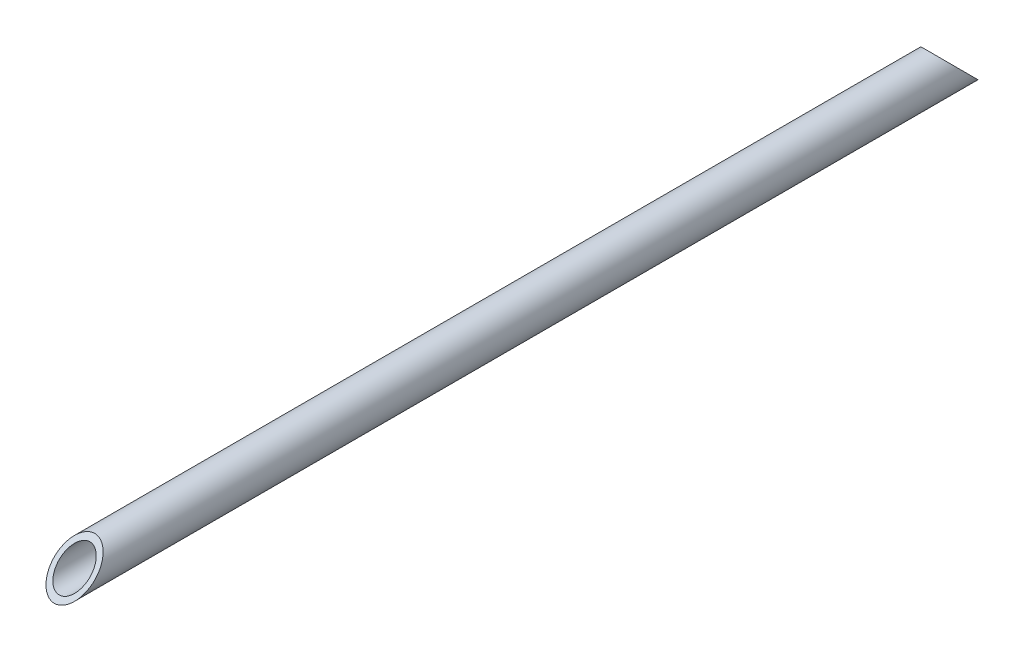
ISO-10303-21;
HEADER;
FILE_DESCRIPTION(('STEP AP214'),'2;1');
FILE_NAME('part.step','',(''),(''),'','','');
FILE_SCHEMA(('AUTOMOTIVE_DESIGN { 1 0 10303 214 1 1 1 1 }'));
ENDSEC;
DATA;
#1=APPLICATION_CONTEXT('core data for automotive mechanical design processes');
#2=APPLICATION_PROTOCOL_DEFINITION('international standard','automotive_design',2000,#1);
#3=PRODUCT_CONTEXT('',#1,'mechanical');
#4=PRODUCT('Part','Part','',(#3));
#5=PRODUCT_RELATED_PRODUCT_CATEGORY('part','',(#4));
#6=PRODUCT_DEFINITION_FORMATION('','',#4);
#7=PRODUCT_DEFINITION_CONTEXT('part definition',#1,'design');
#8=PRODUCT_DEFINITION('design','',#6,#7);
#9=PRODUCT_DEFINITION_SHAPE('','',#8);
#10=(LENGTH_UNIT() NAMED_UNIT(*) SI_UNIT(.MILLI.,.METRE.));
#11=(NAMED_UNIT(*) PLANE_ANGLE_UNIT() SI_UNIT($,.RADIAN.));
#12=(NAMED_UNIT(*) SI_UNIT($,.STERADIAN.) SOLID_ANGLE_UNIT());
#13=UNCERTAINTY_MEASURE_WITH_UNIT(LENGTH_MEASURE(1.E-05),#10,'distance_accuracy_value','');
#14=(GEOMETRIC_REPRESENTATION_CONTEXT(3) GLOBAL_UNCERTAINTY_ASSIGNED_CONTEXT((#13)) GLOBAL_UNIT_ASSIGNED_CONTEXT((#10,
#11,#12)) REPRESENTATION_CONTEXT('',''));
#15=CARTESIAN_POINT('',(0.,0.,0.));
#16=DIRECTION('',(0.,0.,1.));
#17=DIRECTION('',(1.,0.,0.));
#18=AXIS2_PLACEMENT_3D('',#15,#16,#17);
#19=CARTESIAN_POINT('',(2599.99999999996,0.,-275.000000000001));
#20=DIRECTION('',(0.,0.,1.));
#21=DIRECTION('',(0.,-1.,0.));
#22=AXIS2_PLACEMENT_3D('',#19,#20,#21);
#23=CYLINDRICAL_SURFACE('',#22,9.64999999999982);
#24=CARTESIAN_POINT('',(2599.99999999996,0.,-275.000000000001));
#25=DIRECTION('',(0.,0.707106781186548,-0.707106781186547));
#26=DIRECTION('',(0.,0.707106781186548,0.707106781186547));
#27=AXIS2_PLACEMENT_3D('',#24,#25,#26);
#28=ELLIPSE('',#27,13.6471608769,9.64999999999982);
#29=CARTESIAN_POINT('',(2599.99999999996,9.64999999999974,-265.350000000001));
#30=VERTEX_POINT('',#29);
#31=EDGE_CURVE('E55',#30,#30,#28,.T.);
#32=ORIENTED_EDGE('',*,*,#31,.T.);
#33=EDGE_LOOP('',(#32));
#34=FACE_BOUND('',#33,.T.);
#35=CARTESIAN_POINT('',(2599.99999999996,-4.18287908650339E-12,275.));
#36=DIRECTION('',(0.,0.707106781186547,0.707106781186547));
#37=DIRECTION('',(0.,-0.707106781186548,0.707106781186547));
#38=AXIS2_PLACEMENT_3D('',#35,#36,#37);
#39=ELLIPSE('',#38,13.6471608769002,9.64999999999982);
#40=CARTESIAN_POINT('',(2599.99999999996,-9.65000000000407,284.65));
#41=VERTEX_POINT('',#40);
#42=EDGE_CURVE('E42',#41,#41,#39,.T.);
#43=ORIENTED_EDGE('',*,*,#42,.T.);
#44=EDGE_LOOP('',(#43));
#45=FACE_BOUND('',#44,.T.);
#46=ADVANCED_FACE('F38',(#34,#45),#23,.F.);
#47=CARTESIAN_POINT('',(2599.99999999996,0.,-275.000000000001));
#48=DIRECTION('',(0.,0.,1.));
#49=DIRECTION('',(0.,-1.,0.));
#50=AXIS2_PLACEMENT_3D('',#47,#48,#49);
#51=CYLINDRICAL_SURFACE('',#50,12.6999999999999);
#52=CARTESIAN_POINT('',(2599.99999999996,0.,-275.000000000001));
#53=DIRECTION('',(0.,0.707106781186548,-0.707106781186547));
#54=DIRECTION('',(0.,0.707106781186548,0.707106781186547));
#55=AXIS2_PLACEMENT_3D('',#52,#53,#54);
#56=ELLIPSE('',#55,17.960512242138,12.6999999999999);
#57=CARTESIAN_POINT('',(2599.99999999996,12.6999999999998,-262.300000000001));
#58=VERTEX_POINT('',#57);
#59=EDGE_CURVE('E47',#58,#58,#56,.T.);
#60=ORIENTED_EDGE('',*,*,#59,.F.);
#61=EDGE_LOOP('',(#60));
#62=FACE_BOUND('',#61,.T.);
#63=CARTESIAN_POINT('',(2599.99999999996,-4.18287908650339E-12,275.));
#64=DIRECTION('',(0.,0.707106781186547,0.707106781186547));
#65=DIRECTION('',(0.,-0.707106781186548,0.707106781186547));
#66=AXIS2_PLACEMENT_3D('',#63,#64,#65);
#67=ELLIPSE('',#66,17.9605122421383,12.6999999999999);
#68=CARTESIAN_POINT('',(2599.99999999996,-12.7000000000042,287.7));
#69=VERTEX_POINT('',#68);
#70=EDGE_CURVE('E10',#69,#69,#67,.T.);
#71=ORIENTED_EDGE('',*,*,#70,.F.);
#72=EDGE_LOOP('',(#71));
#73=FACE_BOUND('',#72,.T.);
#74=ADVANCED_FACE('F72',(#62,#73),#51,.T.);
#75=CARTESIAN_POINT('',(2599.99999999996,0.,-275.000000000001));
#76=DIRECTION('',(0.,0.707106781186548,-0.707106781186547));
#77=DIRECTION('',(0.,0.707106781186548,0.707106781186547));
#78=AXIS2_PLACEMENT_3D('',#75,#76,#77);
#79=PLANE('',#78);
#80=ORIENTED_EDGE('',*,*,#31,.F.);
#81=EDGE_LOOP('',(#80));
#82=FACE_BOUND('',#81,.T.);
#83=ORIENTED_EDGE('',*,*,#59,.T.);
#84=EDGE_LOOP('',(#83));
#85=FACE_BOUND('',#84,.T.);
#86=ADVANCED_FACE('F68',(#82,#85),#79,.T.);
#87=CARTESIAN_POINT('',(2599.99999999996,-4.18287908650339E-12,275.));
#88=DIRECTION('',(0.,0.707106781186547,0.707106781186547));
#89=DIRECTION('',(0.,-0.707106781186548,0.707106781186547));
#90=AXIS2_PLACEMENT_3D('',#87,#88,#89);
#91=PLANE('',#90);
#92=ORIENTED_EDGE('',*,*,#42,.F.);
#93=EDGE_LOOP('',(#92));
#94=FACE_BOUND('',#93,.T.);
#95=ORIENTED_EDGE('',*,*,#70,.T.);
#96=EDGE_LOOP('',(#95));
#97=FACE_BOUND('',#96,.T.);
#98=ADVANCED_FACE('F40',(#94,#97),#91,.T.);
#99=CLOSED_SHELL('',(#46,#74,#86,#98));
#100=MANIFOLD_SOLID_BREP('B2',#99);
#101=ADVANCED_BREP_SHAPE_REPRESENTATION('',(#18,#100),#14);
#102=SHAPE_DEFINITION_REPRESENTATION(#9,#101);
ENDSEC;
END-ISO-10303-21;
